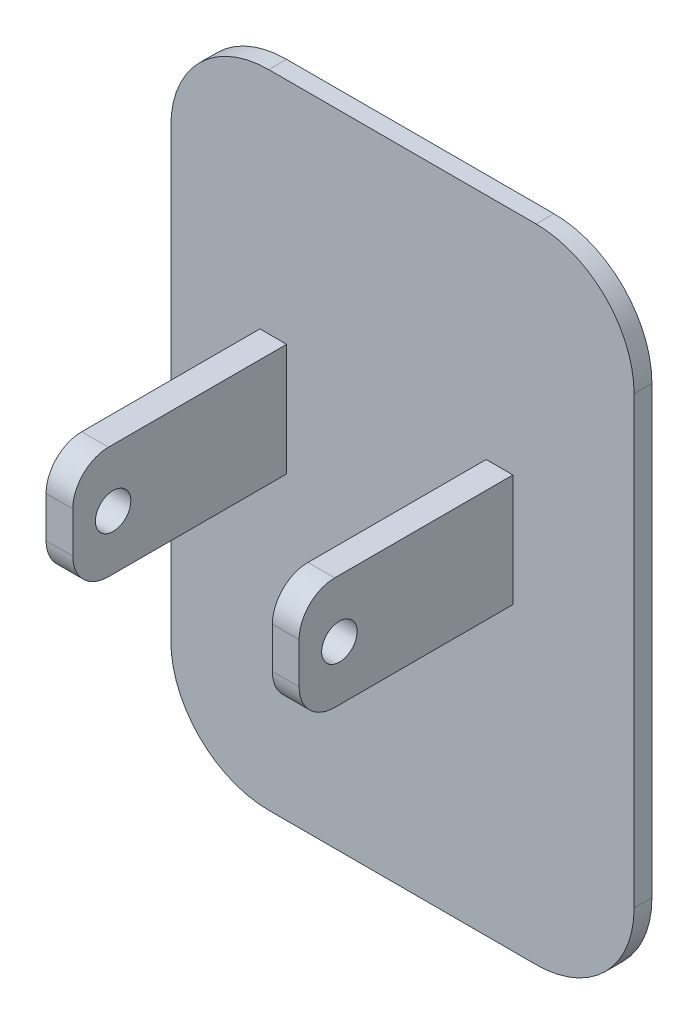
ISO-10303-21;
HEADER;
FILE_DESCRIPTION(('STEP AP214'),'2;1');
FILE_NAME('part.step','',(''),(''),'','','');
FILE_SCHEMA(('AUTOMOTIVE_DESIGN { 1 0 10303 214 1 1 1 1 }'));
ENDSEC;
DATA;
#1=APPLICATION_CONTEXT('core data for automotive mechanical design processes');
#2=APPLICATION_PROTOCOL_DEFINITION('international standard','automotive_design',2000,#1);
#3=PRODUCT_CONTEXT('',#1,'mechanical');
#4=PRODUCT('Part','Part','',(#3));
#5=PRODUCT_RELATED_PRODUCT_CATEGORY('part','',(#4));
#6=PRODUCT_DEFINITION_FORMATION('','',#4);
#7=PRODUCT_DEFINITION_CONTEXT('part definition',#1,'design');
#8=PRODUCT_DEFINITION('design','',#6,#7);
#9=PRODUCT_DEFINITION_SHAPE('','',#8);
#10=(LENGTH_UNIT() NAMED_UNIT(*) SI_UNIT(.MILLI.,.METRE.));
#11=(NAMED_UNIT(*) PLANE_ANGLE_UNIT() SI_UNIT($,.RADIAN.));
#12=(NAMED_UNIT(*) SI_UNIT($,.STERADIAN.) SOLID_ANGLE_UNIT());
#13=UNCERTAINTY_MEASURE_WITH_UNIT(LENGTH_MEASURE(1.E-05),#10,'distance_accuracy_value','');
#14=(GEOMETRIC_REPRESENTATION_CONTEXT(3) GLOBAL_UNCERTAINTY_ASSIGNED_CONTEXT((#13)) GLOBAL_UNIT_ASSIGNED_CONTEXT((#10,
#11,#12)) REPRESENTATION_CONTEXT('',''));
#15=CARTESIAN_POINT('',(0.,0.,0.));
#16=DIRECTION('',(0.,0.,1.));
#17=DIRECTION('',(1.,0.,0.));
#18=AXIS2_PLACEMENT_3D('',#15,#16,#17);
#19=CARTESIAN_POINT('',(5.6,0.713496203822698,13.));
#20=DIRECTION('',(1.,0.,0.));
#21=DIRECTION('',(0.,0.,-1.));
#22=AXIS2_PLACEMENT_3D('',#19,#20,#21);
#23=PLANE('',#22);
#24=CARTESIAN_POINT('',(5.6,3.78102445689793,10.7396030722265));
#25=DIRECTION('',(1.,0.,0.));
#26=DIRECTION('',(0.,0.,-1.));
#27=AXIS2_PLACEMENT_3D('',#24,#25,#26);
#28=CIRCLE('',#27,0.994767201304551);
#29=CARTESIAN_POINT('',(5.6,3.78102445689793,9.74483587092197));
#30=VERTEX_POINT('',#29);
#31=EDGE_CURVE('E248',#30,#30,#28,.T.);
#32=ORIENTED_EDGE('',*,*,#31,.T.);
#33=EDGE_LOOP('',(#32));
#34=FACE_BOUND('',#33,.T.);
#35=DIRECTION('',(0.,-1.,0.));
#36=VECTOR('',#35,1.);
#37=CARTESIAN_POINT('',(5.6,0.713496203822698,13.));
#38=LINE('',#37,#36);
#39=CARTESIAN_POINT('',(5.6,5.0134962038227,13.));
#40=VERTEX_POINT('',#39);
#41=CARTESIAN_POINT('',(5.6,2.7134962038227,13.));
#42=VERTEX_POINT('',#41);
#43=EDGE_CURVE('E117',#40,#42,#38,.T.);
#44=ORIENTED_EDGE('',*,*,#43,.F.);
#45=CARTESIAN_POINT('',(5.6,5.0134962038227,11.));
#46=DIRECTION('',(1.,0.,0.));
#47=DIRECTION('',(0.,0.,-1.));
#48=AXIS2_PLACEMENT_3D('',#45,#46,#47);
#49=CIRCLE('',#48,2.);
#50=CARTESIAN_POINT('',(5.6,7.0134962038227,11.));
#51=VERTEX_POINT('',#50);
#52=EDGE_CURVE('E106',#40,#51,#49,.F.);
#53=ORIENTED_EDGE('',*,*,#52,.T.);
#54=DIRECTION('',(0.,0.,-1.));
#55=VECTOR('',#54,1.);
#56=CARTESIAN_POINT('',(5.6,7.0134962038227,13.));
#57=LINE('',#56,#55);
#58=CARTESIAN_POINT('',(5.6,7.0134962038227,1.));
#59=VERTEX_POINT('',#58);
#60=EDGE_CURVE('E100',#51,#59,#57,.T.);
#61=ORIENTED_EDGE('',*,*,#60,.T.);
#62=DIRECTION('',(0.,-1.,0.));
#63=VECTOR('',#62,1.);
#64=CARTESIAN_POINT('',(5.6,0.713496203822698,1.));
#65=LINE('',#64,#63);
#66=CARTESIAN_POINT('',(5.6,0.713496203822698,1.));
#67=VERTEX_POINT('',#66);
#68=EDGE_CURVE('E105',#59,#67,#65,.T.);
#69=ORIENTED_EDGE('',*,*,#68,.T.);
#70=DIRECTION('',(0.,0.,-1.));
#71=VECTOR('',#70,1.);
#72=CARTESIAN_POINT('',(5.6,0.713496203822698,13.));
#73=LINE('',#72,#71);
#74=CARTESIAN_POINT('',(5.6,0.713496203822698,11.));
#75=VERTEX_POINT('',#74);
#76=EDGE_CURVE('E250',#75,#67,#73,.T.);
#77=ORIENTED_EDGE('',*,*,#76,.F.);
#78=CARTESIAN_POINT('',(5.6,2.7134962038227,11.));
#79=DIRECTION('',(1.,0.,0.));
#80=DIRECTION('',(0.,0.,-1.));
#81=AXIS2_PLACEMENT_3D('',#78,#79,#80);
#82=CIRCLE('',#81,2.);
#83=EDGE_CURVE('E137',#75,#42,#82,.F.);
#84=ORIENTED_EDGE('',*,*,#83,.T.);
#85=EDGE_LOOP('',(#44,#53,#61,#69,#77,#84));
#86=FACE_BOUND('',#85,.T.);
#87=ADVANCED_FACE('F48',(#34,#86),#23,.F.);
#88=CARTESIAN_POINT('',(5.6,0.713496203822698,13.));
#89=DIRECTION('',(0.,1.,0.));
#90=DIRECTION('',(0.,0.,1.));
#91=AXIS2_PLACEMENT_3D('',#88,#89,#90);
#92=PLANE('',#91);
#93=DIRECTION('',(0.,0.,-1.));
#94=VECTOR('',#93,1.);
#95=CARTESIAN_POINT('',(7.1,0.713496203822698,13.));
#96=LINE('',#95,#94);
#97=CARTESIAN_POINT('',(7.1,0.713496203822698,11.));
#98=VERTEX_POINT('',#97);
#99=CARTESIAN_POINT('',(7.1,0.713496203822698,1.));
#100=VERTEX_POINT('',#99);
#101=EDGE_CURVE('E254',#98,#100,#96,.T.);
#102=ORIENTED_EDGE('',*,*,#101,.F.);
#103=DIRECTION('',(1.,0.,0.));
#104=VECTOR('',#103,1.);
#105=CARTESIAN_POINT('',(5.6,0.713496203822698,11.));
#106=LINE('',#105,#104);
#107=EDGE_CURVE('E12',#98,#75,#106,.F.);
#108=ORIENTED_EDGE('',*,*,#107,.T.);
#109=ORIENTED_EDGE('',*,*,#76,.T.);
#110=DIRECTION('',(1.,0.,0.));
#111=VECTOR('',#110,1.);
#112=CARTESIAN_POINT('',(5.6,0.713496203822698,1.));
#113=LINE('',#112,#111);
#114=EDGE_CURVE('E122',#67,#100,#113,.T.);
#115=ORIENTED_EDGE('',*,*,#114,.T.);
#116=EDGE_LOOP('',(#102,#108,#109,#115));
#117=FACE_BOUND('',#116,.T.);
#118=ADVANCED_FACE('F160',(#117),#92,.F.);
#119=CARTESIAN_POINT('',(7.1,0.713496203822698,13.));
#120=DIRECTION('',(-1.,0.,0.));
#121=DIRECTION('',(0.,0.,1.));
#122=AXIS2_PLACEMENT_3D('',#119,#120,#121);
#123=PLANE('',#122);
#124=CARTESIAN_POINT('',(7.1,3.78102445689793,10.7396030722265));
#125=DIRECTION('',(1.,0.,0.));
#126=DIRECTION('',(0.,0.,-1.));
#127=AXIS2_PLACEMENT_3D('',#124,#125,#126);
#128=CIRCLE('',#127,0.994767201304551);
#129=CARTESIAN_POINT('',(7.1,3.78102445689793,9.74483587092197));
#130=VERTEX_POINT('',#129);
#131=EDGE_CURVE('E247',#130,#130,#128,.T.);
#132=ORIENTED_EDGE('',*,*,#131,.F.);
#133=EDGE_LOOP('',(#132));
#134=FACE_BOUND('',#133,.T.);
#135=DIRECTION('',(0.,0.,-1.));
#136=VECTOR('',#135,1.);
#137=CARTESIAN_POINT('',(7.1,7.0134962038227,13.));
#138=LINE('',#137,#136);
#139=CARTESIAN_POINT('',(7.1,7.0134962038227,11.));
#140=VERTEX_POINT('',#139);
#141=CARTESIAN_POINT('',(7.1,7.0134962038227,1.));
#142=VERTEX_POINT('',#141);
#143=EDGE_CURVE('E108',#140,#142,#138,.T.);
#144=ORIENTED_EDGE('',*,*,#143,.F.);
#145=CARTESIAN_POINT('',(7.1,5.0134962038227,11.));
#146=DIRECTION('',(-1.,0.,0.));
#147=DIRECTION('',(0.,0.,1.));
#148=AXIS2_PLACEMENT_3D('',#145,#146,#147);
#149=CIRCLE('',#148,2.);
#150=CARTESIAN_POINT('',(7.1,5.0134962038227,13.));
#151=VERTEX_POINT('',#150);
#152=EDGE_CURVE('E56',#140,#151,#149,.F.);
#153=ORIENTED_EDGE('',*,*,#152,.T.);
#154=DIRECTION('',(0.,1.,0.));
#155=VECTOR('',#154,1.);
#156=CARTESIAN_POINT('',(7.1,0.713496203822698,13.));
#157=LINE('',#156,#155);
#158=CARTESIAN_POINT('',(7.1,2.7134962038227,13.));
#159=VERTEX_POINT('',#158);
#160=EDGE_CURVE('E107',#159,#151,#157,.T.);
#161=ORIENTED_EDGE('',*,*,#160,.F.);
#162=CARTESIAN_POINT('',(7.1,2.7134962038227,11.));
#163=DIRECTION('',(-1.,0.,0.));
#164=DIRECTION('',(0.,0.,1.));
#165=AXIS2_PLACEMENT_3D('',#162,#163,#164);
#166=CIRCLE('',#165,2.);
#167=EDGE_CURVE('E63',#159,#98,#166,.F.);
#168=ORIENTED_EDGE('',*,*,#167,.T.);
#169=ORIENTED_EDGE('',*,*,#101,.T.);
#170=DIRECTION('',(0.,1.,0.));
#171=VECTOR('',#170,1.);
#172=CARTESIAN_POINT('',(7.1,0.713496203822698,1.));
#173=LINE('',#172,#171);
#174=EDGE_CURVE('E116',#100,#142,#173,.T.);
#175=ORIENTED_EDGE('',*,*,#174,.T.);
#176=EDGE_LOOP('',(#144,#153,#161,#168,#169,#175));
#177=FACE_BOUND('',#176,.T.);
#178=ADVANCED_FACE('F142',(#134,#177),#123,.F.);
#179=CARTESIAN_POINT('',(5.6,7.0134962038227,13.));
#180=DIRECTION('',(0.,-1.,0.));
#181=DIRECTION('',(0.,0.,-1.));
#182=AXIS2_PLACEMENT_3D('',#179,#180,#181);
#183=PLANE('',#182);
#184=ORIENTED_EDGE('',*,*,#60,.F.);
#185=DIRECTION('',(-1.,0.,0.));
#186=VECTOR('',#185,1.);
#187=CARTESIAN_POINT('',(5.6,7.0134962038227,11.));
#188=LINE('',#187,#186);
#189=EDGE_CURVE('E71',#51,#140,#188,.F.);
#190=ORIENTED_EDGE('',*,*,#189,.T.);
#191=ORIENTED_EDGE('',*,*,#143,.T.);
#192=DIRECTION('',(-1.,0.,0.));
#193=VECTOR('',#192,1.);
#194=CARTESIAN_POINT('',(5.6,7.0134962038227,1.));
#195=LINE('',#194,#193);
#196=EDGE_CURVE('E111',#142,#59,#195,.T.);
#197=ORIENTED_EDGE('',*,*,#196,.T.);
#198=EDGE_LOOP('',(#184,#190,#191,#197));
#199=FACE_BOUND('',#198,.T.);
#200=ADVANCED_FACE('F112',(#199),#183,.F.);
#201=CARTESIAN_POINT('',(0.,0.,13.));
#202=DIRECTION('',(0.,0.,-1.));
#203=DIRECTION('',(-1.,0.,0.));
#204=AXIS2_PLACEMENT_3D('',#201,#202,#203);
#205=PLANE('',#204);
#206=ORIENTED_EDGE('',*,*,#160,.T.);
#207=DIRECTION('',(-1.,0.,0.));
#208=VECTOR('',#207,1.);
#209=CARTESIAN_POINT('',(0.,5.0134962038227,13.));
#210=LINE('',#209,#208);
#211=EDGE_CURVE('E126',#151,#40,#210,.T.);
#212=ORIENTED_EDGE('',*,*,#211,.T.);
#213=ORIENTED_EDGE('',*,*,#43,.T.);
#214=DIRECTION('',(1.,0.,0.));
#215=VECTOR('',#214,1.);
#216=CARTESIAN_POINT('',(0.,2.7134962038227,13.));
#217=LINE('',#216,#215);
#218=EDGE_CURVE('E123',#42,#159,#217,.T.);
#219=ORIENTED_EDGE('',*,*,#218,.T.);
#220=EDGE_LOOP('',(#206,#212,#213,#219));
#221=FACE_BOUND('',#220,.T.);
#222=ADVANCED_FACE('F146',(#221),#205,.F.);
#223=CARTESIAN_POINT('',(0.,0.,1.));
#224=DIRECTION('',(0.,0.,-1.));
#225=DIRECTION('',(-1.,0.,0.));
#226=AXIS2_PLACEMENT_3D('',#223,#224,#225);
#227=PLANE('',#226);
#228=ORIENTED_EDGE('',*,*,#68,.F.);
#229=ORIENTED_EDGE('',*,*,#196,.F.);
#230=ORIENTED_EDGE('',*,*,#174,.F.);
#231=ORIENTED_EDGE('',*,*,#114,.F.);
#232=EDGE_LOOP('',(#228,#229,#230,#231));
#233=FACE_BOUND('',#232,.T.);
#234=ADVANCED_FACE('F120',(#233),#227,.T.);
#235=CARTESIAN_POINT('',(-12.1,3.78102445689793,10.7396030722265));
#236=DIRECTION('',(1.,0.,0.));
#237=DIRECTION('',(0.,0.,-1.));
#238=AXIS2_PLACEMENT_3D('',#235,#236,#237);
#239=CYLINDRICAL_SURFACE('',#238,0.994767201304551);
#240=ORIENTED_EDGE('',*,*,#131,.T.);
#241=EDGE_LOOP('',(#240));
#242=FACE_BOUND('',#241,.T.);
#243=ORIENTED_EDGE('',*,*,#31,.F.);
#244=EDGE_LOOP('',(#243));
#245=FACE_BOUND('',#244,.T.);
#246=ADVANCED_FACE('F150',(#242,#245),#239,.F.);
#247=CARTESIAN_POINT('',(0.,5.0134962038227,11.));
#248=DIRECTION('',(-1.,0.,0.));
#249=DIRECTION('',(0.,0.,1.));
#250=AXIS2_PLACEMENT_3D('',#247,#248,#249);
#251=CYLINDRICAL_SURFACE('',#250,2.);
#252=ORIENTED_EDGE('',*,*,#152,.F.);
#253=ORIENTED_EDGE('',*,*,#189,.F.);
#254=ORIENTED_EDGE('',*,*,#52,.F.);
#255=ORIENTED_EDGE('',*,*,#211,.F.);
#256=EDGE_LOOP('',(#252,#253,#254,#255));
#257=FACE_BOUND('',#256,.T.);
#258=ADVANCED_FACE('F148',(#257),#251,.T.);
#259=CARTESIAN_POINT('',(0.,2.7134962038227,11.));
#260=DIRECTION('',(1.,0.,0.));
#261=DIRECTION('',(0.,0.,-1.));
#262=AXIS2_PLACEMENT_3D('',#259,#260,#261);
#263=CYLINDRICAL_SURFACE('',#262,2.);
#264=ORIENTED_EDGE('',*,*,#83,.F.);
#265=ORIENTED_EDGE('',*,*,#107,.F.);
#266=ORIENTED_EDGE('',*,*,#167,.F.);
#267=ORIENTED_EDGE('',*,*,#218,.F.);
#268=EDGE_LOOP('',(#264,#265,#266,#267));
#269=FACE_BOUND('',#268,.T.);
#270=ADVANCED_FACE('F50',(#269),#263,.T.);
#271=CLOSED_SHELL('',(#87,#118,#178,#200,#222,#234,#246,#258,#270));
#272=MANIFOLD_SOLID_BREP('B2',#271);
#273=CARTESIAN_POINT('',(-7.1,0.713496203822699,13.));
#274=DIRECTION('',(1.,0.,0.));
#275=DIRECTION('',(0.,0.,-1.));
#276=AXIS2_PLACEMENT_3D('',#273,#274,#275);
#277=PLANE('',#276);
#278=CARTESIAN_POINT('',(-7.1,3.78102445689793,10.7396030722265));
#279=DIRECTION('',(1.,0.,0.));
#280=DIRECTION('',(0.,0.,-1.));
#281=AXIS2_PLACEMENT_3D('',#278,#279,#280);
#282=CIRCLE('',#281,0.994767201304551);
#283=CARTESIAN_POINT('',(-7.1,3.78102445689793,9.74483587092197));
#284=VERTEX_POINT('',#283);
#285=EDGE_CURVE('E348',#284,#284,#282,.T.);
#286=ORIENTED_EDGE('',*,*,#285,.T.);
#287=EDGE_LOOP('',(#286));
#288=FACE_BOUND('',#287,.T.);
#289=DIRECTION('',(0.,-1.,0.));
#290=VECTOR('',#289,1.);
#291=CARTESIAN_POINT('',(-7.1,0.713496203822699,13.));
#292=LINE('',#291,#290);
#293=CARTESIAN_POINT('',(-7.1,5.0134962038227,13.));
#294=VERTEX_POINT('',#293);
#295=CARTESIAN_POINT('',(-7.1,2.7134962038227,13.));
#296=VERTEX_POINT('',#295);
#297=EDGE_CURVE('E360',#294,#296,#292,.T.);
#298=ORIENTED_EDGE('',*,*,#297,.F.);
#299=CARTESIAN_POINT('',(-7.1,5.0134962038227,11.));
#300=DIRECTION('',(1.,0.,0.));
#301=DIRECTION('',(0.,0.,-1.));
#302=AXIS2_PLACEMENT_3D('',#299,#300,#301);
#303=CIRCLE('',#302,2.);
#304=CARTESIAN_POINT('',(-7.1,7.0134962038227,11.));
#305=VERTEX_POINT('',#304);
#306=EDGE_CURVE('E374',#294,#305,#303,.F.);
#307=ORIENTED_EDGE('',*,*,#306,.T.);
#308=DIRECTION('',(0.,0.,-1.));
#309=VECTOR('',#308,1.);
#310=CARTESIAN_POINT('',(-7.1,7.0134962038227,13.));
#311=LINE('',#310,#309);
#312=CARTESIAN_POINT('',(-7.1,7.0134962038227,1.));
#313=VERTEX_POINT('',#312);
#314=EDGE_CURVE('E346',#305,#313,#311,.T.);
#315=ORIENTED_EDGE('',*,*,#314,.T.);
#316=DIRECTION('',(0.,-1.,0.));
#317=VECTOR('',#316,1.);
#318=CARTESIAN_POINT('',(-7.1,0.713496203822699,1.));
#319=LINE('',#318,#317);
#320=CARTESIAN_POINT('',(-7.1,0.713496203822699,1.));
#321=VERTEX_POINT('',#320);
#322=EDGE_CURVE('E341',#313,#321,#319,.T.);
#323=ORIENTED_EDGE('',*,*,#322,.T.);
#324=DIRECTION('',(0.,0.,-1.));
#325=VECTOR('',#324,1.);
#326=CARTESIAN_POINT('',(-7.1,0.713496203822699,13.));
#327=LINE('',#326,#325);
#328=CARTESIAN_POINT('',(-7.1,0.713496203822699,11.));
#329=VERTEX_POINT('',#328);
#330=EDGE_CURVE('E325',#329,#321,#327,.T.);
#331=ORIENTED_EDGE('',*,*,#330,.F.);
#332=CARTESIAN_POINT('',(-7.1,2.7134962038227,11.));
#333=DIRECTION('',(1.,0.,0.));
#334=DIRECTION('',(0.,0.,-1.));
#335=AXIS2_PLACEMENT_3D('',#332,#333,#334);
#336=CIRCLE('',#335,2.);
#337=EDGE_CURVE('E372',#329,#296,#336,.F.);
#338=ORIENTED_EDGE('',*,*,#337,.T.);
#339=EDGE_LOOP('',(#298,#307,#315,#323,#331,#338));
#340=FACE_BOUND('',#339,.T.);
#341=ADVANCED_FACE('F272',(#288,#340),#277,.F.);
#342=CARTESIAN_POINT('',(-7.1,0.713496203822699,13.));
#343=DIRECTION('',(0.,1.,0.));
#344=DIRECTION('',(0.,0.,1.));
#345=AXIS2_PLACEMENT_3D('',#342,#343,#344);
#346=PLANE('',#345);
#347=DIRECTION('',(0.,0.,-1.));
#348=VECTOR('',#347,1.);
#349=CARTESIAN_POINT('',(-5.6,0.713496203822699,13.));
#350=LINE('',#349,#348);
#351=CARTESIAN_POINT('',(-5.6,0.713496203822699,11.));
#352=VERTEX_POINT('',#351);
#353=CARTESIAN_POINT('',(-5.6,0.713496203822699,1.));
#354=VERTEX_POINT('',#353);
#355=EDGE_CURVE('E335',#352,#354,#350,.T.);
#356=ORIENTED_EDGE('',*,*,#355,.F.);
#357=DIRECTION('',(1.,0.,0.));
#358=VECTOR('',#357,1.);
#359=CARTESIAN_POINT('',(-7.1,0.713496203822699,11.));
#360=LINE('',#359,#358);
#361=EDGE_CURVE('E46',#352,#329,#360,.F.);
#362=ORIENTED_EDGE('',*,*,#361,.T.);
#363=ORIENTED_EDGE('',*,*,#330,.T.);
#364=DIRECTION('',(1.,0.,0.));
#365=VECTOR('',#364,1.);
#366=CARTESIAN_POINT('',(-7.1,0.713496203822699,1.));
#367=LINE('',#366,#365);
#368=EDGE_CURVE('E328',#321,#354,#367,.T.);
#369=ORIENTED_EDGE('',*,*,#368,.T.);
#370=EDGE_LOOP('',(#356,#362,#363,#369));
#371=FACE_BOUND('',#370,.T.);
#372=ADVANCED_FACE('F327',(#371),#346,.F.);
#373=CARTESIAN_POINT('',(-5.6,0.713496203822699,13.));
#374=DIRECTION('',(-1.,0.,0.));
#375=DIRECTION('',(0.,0.,1.));
#376=AXIS2_PLACEMENT_3D('',#373,#374,#375);
#377=PLANE('',#376);
#378=CARTESIAN_POINT('',(-5.6,3.78102445689793,10.7396030722265));
#379=DIRECTION('',(-1.,0.,0.));
#380=DIRECTION('',(0.,0.,1.));
#381=AXIS2_PLACEMENT_3D('',#378,#379,#380);
#382=CIRCLE('',#381,0.994767201304551);
#383=CARTESIAN_POINT('',(-5.6,3.78102445689793,11.7343702735311));
#384=VERTEX_POINT('',#383);
#385=EDGE_CURVE('E351',#384,#384,#382,.T.);
#386=ORIENTED_EDGE('',*,*,#385,.T.);
#387=EDGE_LOOP('',(#386));
#388=FACE_BOUND('',#387,.T.);
#389=DIRECTION('',(0.,0.,-1.));
#390=VECTOR('',#389,1.);
#391=CARTESIAN_POINT('',(-5.6,7.0134962038227,13.));
#392=LINE('',#391,#390);
#393=CARTESIAN_POINT('',(-5.6,7.0134962038227,11.));
#394=VERTEX_POINT('',#393);
#395=CARTESIAN_POINT('',(-5.6,7.0134962038227,1.));
#396=VERTEX_POINT('',#395);
#397=EDGE_CURVE('E362',#394,#396,#392,.T.);
#398=ORIENTED_EDGE('',*,*,#397,.F.);
#399=CARTESIAN_POINT('',(-5.6,5.0134962038227,11.));
#400=DIRECTION('',(-1.,0.,0.));
#401=DIRECTION('',(0.,0.,1.));
#402=AXIS2_PLACEMENT_3D('',#399,#400,#401);
#403=CIRCLE('',#402,2.);
#404=CARTESIAN_POINT('',(-5.6,5.0134962038227,13.));
#405=VERTEX_POINT('',#404);
#406=EDGE_CURVE('E280',#394,#405,#403,.F.);
#407=ORIENTED_EDGE('',*,*,#406,.T.);
#408=DIRECTION('',(0.,1.,0.));
#409=VECTOR('',#408,1.);
#410=CARTESIAN_POINT('',(-5.6,0.713496203822699,13.));
#411=LINE('',#410,#409);
#412=CARTESIAN_POINT('',(-5.6,2.7134962038227,13.));
#413=VERTEX_POINT('',#412);
#414=EDGE_CURVE('E354',#413,#405,#411,.T.);
#415=ORIENTED_EDGE('',*,*,#414,.F.);
#416=CARTESIAN_POINT('',(-5.6,2.7134962038227,11.));
#417=DIRECTION('',(-1.,0.,0.));
#418=DIRECTION('',(0.,0.,1.));
#419=AXIS2_PLACEMENT_3D('',#416,#417,#418);
#420=CIRCLE('',#419,2.);
#421=EDGE_CURVE('E287',#413,#352,#420,.F.);
#422=ORIENTED_EDGE('',*,*,#421,.T.);
#423=ORIENTED_EDGE('',*,*,#355,.T.);
#424=DIRECTION('',(0.,1.,0.));
#425=VECTOR('',#424,1.);
#426=CARTESIAN_POINT('',(-5.6,0.713496203822699,1.));
#427=LINE('',#426,#425);
#428=EDGE_CURVE('E343',#354,#396,#427,.T.);
#429=ORIENTED_EDGE('',*,*,#428,.T.);
#430=EDGE_LOOP('',(#398,#407,#415,#422,#423,#429));
#431=FACE_BOUND('',#430,.T.);
#432=ADVANCED_FACE('F379',(#388,#431),#377,.F.);
#433=CARTESIAN_POINT('',(-7.1,7.0134962038227,13.));
#434=DIRECTION('',(0.,-1.,0.));
#435=DIRECTION('',(0.,0.,-1.));
#436=AXIS2_PLACEMENT_3D('',#433,#434,#435);
#437=PLANE('',#436);
#438=ORIENTED_EDGE('',*,*,#314,.F.);
#439=DIRECTION('',(-1.,0.,0.));
#440=VECTOR('',#439,1.);
#441=CARTESIAN_POINT('',(-7.1,7.0134962038227,11.));
#442=LINE('',#441,#440);
#443=EDGE_CURVE('E295',#305,#394,#442,.F.);
#444=ORIENTED_EDGE('',*,*,#443,.T.);
#445=ORIENTED_EDGE('',*,*,#397,.T.);
#446=DIRECTION('',(-1.,0.,0.));
#447=VECTOR('',#446,1.);
#448=CARTESIAN_POINT('',(-7.1,7.0134962038227,1.));
#449=LINE('',#448,#447);
#450=EDGE_CURVE('E358',#396,#313,#449,.T.);
#451=ORIENTED_EDGE('',*,*,#450,.T.);
#452=EDGE_LOOP('',(#438,#444,#445,#451));
#453=FACE_BOUND('',#452,.T.);
#454=ADVANCED_FACE('F387',(#453),#437,.F.);
#455=CARTESIAN_POINT('',(0.,0.,13.));
#456=DIRECTION('',(0.,0.,-1.));
#457=DIRECTION('',(-1.,0.,0.));
#458=AXIS2_PLACEMENT_3D('',#455,#456,#457);
#459=PLANE('',#458);
#460=ORIENTED_EDGE('',*,*,#414,.T.);
#461=DIRECTION('',(-1.,0.,0.));
#462=VECTOR('',#461,1.);
#463=CARTESIAN_POINT('',(0.,5.0134962038227,13.));
#464=LINE('',#463,#462);
#465=EDGE_CURVE('E369',#405,#294,#464,.T.);
#466=ORIENTED_EDGE('',*,*,#465,.T.);
#467=ORIENTED_EDGE('',*,*,#297,.T.);
#468=DIRECTION('',(1.,0.,0.));
#469=VECTOR('',#468,1.);
#470=CARTESIAN_POINT('',(0.,2.7134962038227,13.));
#471=LINE('',#470,#469);
#472=EDGE_CURVE('E334',#296,#413,#471,.T.);
#473=ORIENTED_EDGE('',*,*,#472,.T.);
#474=EDGE_LOOP('',(#460,#466,#467,#473));
#475=FACE_BOUND('',#474,.T.);
#476=ADVANCED_FACE('F383',(#475),#459,.F.);
#477=CARTESIAN_POINT('',(0.,0.,1.));
#478=DIRECTION('',(0.,0.,-1.));
#479=DIRECTION('',(-1.,0.,0.));
#480=AXIS2_PLACEMENT_3D('',#477,#478,#479);
#481=PLANE('',#480);
#482=ORIENTED_EDGE('',*,*,#322,.F.);
#483=ORIENTED_EDGE('',*,*,#450,.F.);
#484=ORIENTED_EDGE('',*,*,#428,.F.);
#485=ORIENTED_EDGE('',*,*,#368,.F.);
#486=EDGE_LOOP('',(#482,#483,#484,#485));
#487=FACE_BOUND('',#486,.T.);
#488=ADVANCED_FACE('F339',(#487),#481,.T.);
#489=CARTESIAN_POINT('',(-12.1,3.78102445689793,10.7396030722265));
#490=DIRECTION('',(1.,0.,0.));
#491=DIRECTION('',(0.,0.,-1.));
#492=AXIS2_PLACEMENT_3D('',#489,#490,#491);
#493=CYLINDRICAL_SURFACE('',#492,0.994767201304551);
#494=ORIENTED_EDGE('',*,*,#385,.F.);
#495=EDGE_LOOP('',(#494));
#496=FACE_BOUND('',#495,.T.);
#497=ORIENTED_EDGE('',*,*,#285,.F.);
#498=EDGE_LOOP('',(#497));
#499=FACE_BOUND('',#498,.T.);
#500=ADVANCED_FACE('F393',(#496,#499),#493,.F.);
#501=CARTESIAN_POINT('',(0.,5.0134962038227,11.));
#502=DIRECTION('',(-1.,0.,0.));
#503=DIRECTION('',(0.,0.,1.));
#504=AXIS2_PLACEMENT_3D('',#501,#502,#503);
#505=CYLINDRICAL_SURFACE('',#504,2.);
#506=ORIENTED_EDGE('',*,*,#406,.F.);
#507=ORIENTED_EDGE('',*,*,#443,.F.);
#508=ORIENTED_EDGE('',*,*,#306,.F.);
#509=ORIENTED_EDGE('',*,*,#465,.F.);
#510=EDGE_LOOP('',(#506,#507,#508,#509));
#511=FACE_BOUND('',#510,.T.);
#512=ADVANCED_FACE('F386',(#511),#505,.T.);
#513=CARTESIAN_POINT('',(0.,2.7134962038227,11.));
#514=DIRECTION('',(1.,0.,0.));
#515=DIRECTION('',(0.,0.,-1.));
#516=AXIS2_PLACEMENT_3D('',#513,#514,#515);
#517=CYLINDRICAL_SURFACE('',#516,2.);
#518=ORIENTED_EDGE('',*,*,#337,.F.);
#519=ORIENTED_EDGE('',*,*,#361,.F.);
#520=ORIENTED_EDGE('',*,*,#421,.F.);
#521=ORIENTED_EDGE('',*,*,#472,.F.);
#522=EDGE_LOOP('',(#518,#519,#520,#521));
#523=FACE_BOUND('',#522,.T.);
#524=ADVANCED_FACE('F274',(#523),#517,.T.);
#525=CLOSED_SHELL('',(#341,#372,#432,#454,#476,#488,#500,#512,#524));
#526=MANIFOLD_SOLID_BREP('B6',#525);
#527=CARTESIAN_POINT('',(8.4,-10.637455145618,1.));
#528=DIRECTION('',(0.,0.,1.));
#529=DIRECTION('',(1.,0.,0.));
#530=AXIS2_PLACEMENT_3D('',#527,#528,#529);
#531=PLANE('',#530);
#532=CARTESIAN_POINT('',(8.4,-10.637455145618,1.));
#533=DIRECTION('',(0.,0.,1.));
#534=DIRECTION('',(1.,0.,0.));
#535=AXIS2_PLACEMENT_3D('',#532,#533,#534);
#536=CIRCLE('',#535,5.5);
#537=CARTESIAN_POINT('',(8.4,-16.137455145618,1.));
#538=VERTEX_POINT('',#537);
#539=CARTESIAN_POINT('',(13.9,-10.637455145618,1.));
#540=VERTEX_POINT('',#539);
#541=EDGE_CURVE('E667',#538,#540,#536,.T.);
#542=ORIENTED_EDGE('',*,*,#541,.T.);
#543=DIRECTION('',(0.,1.,0.));
#544=VECTOR('',#543,1.);
#545=CARTESIAN_POINT('',(13.9,-10.637455145618,1.));
#546=LINE('',#545,#544);
#547=CARTESIAN_POINT('',(13.9,14.362544854382,1.));
#548=VERTEX_POINT('',#547);
#549=EDGE_CURVE('E670',#540,#548,#546,.T.);
#550=ORIENTED_EDGE('',*,*,#549,.T.);
#551=CARTESIAN_POINT('',(8.4,14.362544854382,1.));
#552=DIRECTION('',(0.,0.,1.));
#553=DIRECTION('',(1.,0.,0.));
#554=AXIS2_PLACEMENT_3D('',#551,#552,#553);
#555=CIRCLE('',#554,5.5);
#556=CARTESIAN_POINT('',(8.4,19.862544854382,1.));
#557=VERTEX_POINT('',#556);
#558=EDGE_CURVE('E673',#548,#557,#555,.T.);
#559=ORIENTED_EDGE('',*,*,#558,.T.);
#560=DIRECTION('',(-1.,0.,0.));
#561=VECTOR('',#560,1.);
#562=CARTESIAN_POINT('',(8.4,19.862544854382,1.));
#563=LINE('',#562,#561);
#564=CARTESIAN_POINT('',(-6.6,19.862544854382,1.));
#565=VERTEX_POINT('',#564);
#566=EDGE_CURVE('E675',#557,#565,#563,.T.);
#567=ORIENTED_EDGE('',*,*,#566,.T.);
#568=CARTESIAN_POINT('',(-6.6,14.362544854382,1.));
#569=DIRECTION('',(0.,0.,1.));
#570=DIRECTION('',(1.,0.,0.));
#571=AXIS2_PLACEMENT_3D('',#568,#569,#570);
#572=CIRCLE('',#571,5.5);
#573=CARTESIAN_POINT('',(-12.1,14.362544854382,1.));
#574=VERTEX_POINT('',#573);
#575=EDGE_CURVE('E677',#565,#574,#572,.T.);
#576=ORIENTED_EDGE('',*,*,#575,.T.);
#577=DIRECTION('',(0.,-1.,0.));
#578=VECTOR('',#577,1.);
#579=CARTESIAN_POINT('',(-12.1,14.362544854382,1.));
#580=LINE('',#579,#578);
#581=CARTESIAN_POINT('',(-12.1,-10.637455145618,1.));
#582=VERTEX_POINT('',#581);
#583=EDGE_CURVE('E679',#574,#582,#580,.T.);
#584=ORIENTED_EDGE('',*,*,#583,.T.);
#585=CARTESIAN_POINT('',(-6.6,-10.637455145618,1.));
#586=DIRECTION('',(0.,0.,1.));
#587=DIRECTION('',(1.,0.,0.));
#588=AXIS2_PLACEMENT_3D('',#585,#586,#587);
#589=CIRCLE('',#588,5.5);
#590=CARTESIAN_POINT('',(-6.6,-16.137455145618,1.));
#591=VERTEX_POINT('',#590);
#592=EDGE_CURVE('E681',#582,#591,#589,.T.);
#593=ORIENTED_EDGE('',*,*,#592,.T.);
#594=DIRECTION('',(1.,0.,0.));
#595=VECTOR('',#594,1.);
#596=CARTESIAN_POINT('',(-6.6,-16.137455145618,1.));
#597=LINE('',#596,#595);
#598=EDGE_CURVE('E683',#591,#538,#597,.T.);
#599=ORIENTED_EDGE('',*,*,#598,.T.);
#600=EDGE_LOOP('',(#542,#550,#559,#567,#576,#584,#593,#599));
#601=FACE_BOUND('',#600,.T.);
#602=DIRECTION('',(1.,0.,0.));
#603=VECTOR('',#602,1.);
#604=CARTESIAN_POINT('',(-7.1,0.713496203822699,1.));
#605=LINE('',#604,#603);
#606=CARTESIAN_POINT('',(-7.1,0.713496203822699,1.));
#607=VERTEX_POINT('',#606);
#608=CARTESIAN_POINT('',(-5.6,0.713496203822699,1.));
#609=VERTEX_POINT('',#608);
#610=EDGE_CURVE('E638',#607,#609,#605,.T.);
#611=ORIENTED_EDGE('',*,*,#610,.F.);
#612=DIRECTION('',(0.,-1.,0.));
#613=VECTOR('',#612,1.);
#614=CARTESIAN_POINT('',(-7.1,7.0134962038227,1.));
#615=LINE('',#614,#613);
#616=CARTESIAN_POINT('',(-7.1,7.0134962038227,1.));
#617=VERTEX_POINT('',#616);
#618=EDGE_CURVE('E636',#617,#607,#615,.T.);
#619=ORIENTED_EDGE('',*,*,#618,.F.);
#620=DIRECTION('',(-1.,0.,0.));
#621=VECTOR('',#620,1.);
#622=CARTESIAN_POINT('',(-7.1,7.0134962038227,1.));
#623=LINE('',#622,#621);
#624=CARTESIAN_POINT('',(-5.6,7.0134962038227,1.));
#625=VERTEX_POINT('',#624);
#626=EDGE_CURVE('E644',#625,#617,#623,.T.);
#627=ORIENTED_EDGE('',*,*,#626,.F.);
#628=DIRECTION('',(0.,1.,0.));
#629=VECTOR('',#628,1.);
#630=CARTESIAN_POINT('',(-5.6,7.0134962038227,1.));
#631=LINE('',#630,#629);
#632=EDGE_CURVE('E641',#609,#625,#631,.T.);
#633=ORIENTED_EDGE('',*,*,#632,.F.);
#634=EDGE_LOOP('',(#611,#619,#627,#633));
#635=FACE_BOUND('',#634,.T.);
#636=DIRECTION('',(1.,0.,0.));
#637=VECTOR('',#636,1.);
#638=CARTESIAN_POINT('',(5.6,0.713496203822698,1.));
#639=LINE('',#638,#637);
#640=CARTESIAN_POINT('',(5.6,0.713496203822698,1.));
#641=VERTEX_POINT('',#640);
#642=CARTESIAN_POINT('',(7.1,0.713496203822699,1.));
#643=VERTEX_POINT('',#642);
#644=EDGE_CURVE('E608',#641,#643,#639,.T.);
#645=ORIENTED_EDGE('',*,*,#644,.F.);
#646=DIRECTION('',(0.,-1.,0.));
#647=VECTOR('',#646,1.);
#648=CARTESIAN_POINT('',(5.6,0.713496203822698,1.));
#649=LINE('',#648,#647);
#650=CARTESIAN_POINT('',(5.6,7.0134962038227,1.));
#651=VERTEX_POINT('',#650);
#652=EDGE_CURVE('E600',#651,#641,#649,.T.);
#653=ORIENTED_EDGE('',*,*,#652,.F.);
#654=DIRECTION('',(-1.,0.,0.));
#655=VECTOR('',#654,1.);
#656=CARTESIAN_POINT('',(5.6,7.0134962038227,1.));
#657=LINE('',#656,#655);
#658=CARTESIAN_POINT('',(7.1,7.0134962038227,1.));
#659=VERTEX_POINT('',#658);
#660=EDGE_CURVE('E622',#659,#651,#657,.T.);
#661=ORIENTED_EDGE('',*,*,#660,.F.);
#662=DIRECTION('',(0.,1.,0.));
#663=VECTOR('',#662,1.);
#664=CARTESIAN_POINT('',(7.1,0.713496203822699,1.));
#665=LINE('',#664,#663);
#666=EDGE_CURVE('E620',#643,#659,#665,.T.);
#667=ORIENTED_EDGE('',*,*,#666,.F.);
#668=EDGE_LOOP('',(#645,#653,#661,#667));
#669=FACE_BOUND('',#668,.T.);
#670=ADVANCED_FACE('F487',(#601,#635,#669),#531,.T.);
#671=CARTESIAN_POINT('',(8.4,-10.637455145618,0.));
#672=DIRECTION('',(0.,0.,1.));
#673=DIRECTION('',(1.,0.,0.));
#674=AXIS2_PLACEMENT_3D('',#671,#672,#673);
#675=PLANE('',#674);
#676=DIRECTION('',(0.,-1.,0.));
#677=VECTOR('',#676,1.);
#678=CARTESIAN_POINT('',(-7.1,7.0134962038227,0.));
#679=LINE('',#678,#677);
#680=CARTESIAN_POINT('',(-7.1,7.0134962038227,0.));
#681=VERTEX_POINT('',#680);
#682=CARTESIAN_POINT('',(-7.1,0.713496203822699,0.));
#683=VERTEX_POINT('',#682);
#684=EDGE_CURVE('E616',#681,#683,#679,.T.);
#685=ORIENTED_EDGE('',*,*,#684,.T.);
#686=DIRECTION('',(1.,0.,0.));
#687=VECTOR('',#686,1.);
#688=CARTESIAN_POINT('',(-7.1,0.713496203822699,0.));
#689=LINE('',#688,#687);
#690=CARTESIAN_POINT('',(-5.6,0.713496203822699,0.));
#691=VERTEX_POINT('',#690);
#692=EDGE_CURVE('E649',#683,#691,#689,.T.);
#693=ORIENTED_EDGE('',*,*,#692,.T.);
#694=DIRECTION('',(0.,1.,0.));
#695=VECTOR('',#694,1.);
#696=CARTESIAN_POINT('',(-5.6,7.0134962038227,0.));
#697=LINE('',#696,#695);
#698=CARTESIAN_POINT('',(-5.6,7.0134962038227,0.));
#699=VERTEX_POINT('',#698);
#700=EDGE_CURVE('E652',#691,#699,#697,.T.);
#701=ORIENTED_EDGE('',*,*,#700,.T.);
#702=DIRECTION('',(-1.,0.,0.));
#703=VECTOR('',#702,1.);
#704=CARTESIAN_POINT('',(-7.1,7.0134962038227,0.));
#705=LINE('',#704,#703);
#706=EDGE_CURVE('E639',#699,#681,#705,.T.);
#707=ORIENTED_EDGE('',*,*,#706,.T.);
#708=EDGE_LOOP('',(#685,#693,#701,#707));
#709=FACE_BOUND('',#708,.T.);
#710=CARTESIAN_POINT('',(8.4,-10.637455145618,0.));
#711=DIRECTION('',(0.,0.,1.));
#712=DIRECTION('',(1.,0.,0.));
#713=AXIS2_PLACEMENT_3D('',#710,#711,#712);
#714=CIRCLE('',#713,5.5);
#715=CARTESIAN_POINT('',(8.4,-16.137455145618,0.));
#716=VERTEX_POINT('',#715);
#717=CARTESIAN_POINT('',(13.9,-10.637455145618,0.));
#718=VERTEX_POINT('',#717);
#719=EDGE_CURVE('E666',#716,#718,#714,.T.);
#720=ORIENTED_EDGE('',*,*,#719,.F.);
#721=DIRECTION('',(1.,0.,0.));
#722=VECTOR('',#721,1.);
#723=CARTESIAN_POINT('',(-6.6,-16.137455145618,0.));
#724=LINE('',#723,#722);
#725=CARTESIAN_POINT('',(-6.6,-16.137455145618,0.));
#726=VERTEX_POINT('',#725);
#727=EDGE_CURVE('E671',#726,#716,#724,.T.);
#728=ORIENTED_EDGE('',*,*,#727,.F.);
#729=CARTESIAN_POINT('',(-6.6,-10.637455145618,0.));
#730=DIRECTION('',(0.,0.,1.));
#731=DIRECTION('',(1.,0.,0.));
#732=AXIS2_PLACEMENT_3D('',#729,#730,#731);
#733=CIRCLE('',#732,5.5);
#734=CARTESIAN_POINT('',(-12.1,-10.637455145618,0.));
#735=VERTEX_POINT('',#734);
#736=EDGE_CURVE('E698',#735,#726,#733,.T.);
#737=ORIENTED_EDGE('',*,*,#736,.F.);
#738=DIRECTION('',(0.,-1.,0.));
#739=VECTOR('',#738,1.);
#740=CARTESIAN_POINT('',(-12.1,14.362544854382,0.));
#741=LINE('',#740,#739);
#742=CARTESIAN_POINT('',(-12.1,14.362544854382,0.));
#743=VERTEX_POINT('',#742);
#744=EDGE_CURVE('E696',#743,#735,#741,.T.);
#745=ORIENTED_EDGE('',*,*,#744,.F.);
#746=CARTESIAN_POINT('',(-6.6,14.362544854382,0.));
#747=DIRECTION('',(0.,0.,1.));
#748=DIRECTION('',(1.,0.,0.));
#749=AXIS2_PLACEMENT_3D('',#746,#747,#748);
#750=CIRCLE('',#749,5.5);
#751=CARTESIAN_POINT('',(-6.6,19.862544854382,0.));
#752=VERTEX_POINT('',#751);
#753=EDGE_CURVE('E694',#752,#743,#750,.T.);
#754=ORIENTED_EDGE('',*,*,#753,.F.);
#755=DIRECTION('',(-1.,0.,0.));
#756=VECTOR('',#755,1.);
#757=CARTESIAN_POINT('',(8.4,19.862544854382,0.));
#758=LINE('',#757,#756);
#759=CARTESIAN_POINT('',(8.4,19.862544854382,0.));
#760=VERTEX_POINT('',#759);
#761=EDGE_CURVE('E692',#760,#752,#758,.T.);
#762=ORIENTED_EDGE('',*,*,#761,.F.);
#763=CARTESIAN_POINT('',(8.4,14.362544854382,0.));
#764=DIRECTION('',(0.,0.,1.));
#765=DIRECTION('',(1.,0.,0.));
#766=AXIS2_PLACEMENT_3D('',#763,#764,#765);
#767=CIRCLE('',#766,5.5);
#768=CARTESIAN_POINT('',(13.9,14.362544854382,0.));
#769=VERTEX_POINT('',#768);
#770=EDGE_CURVE('E690',#769,#760,#767,.T.);
#771=ORIENTED_EDGE('',*,*,#770,.F.);
#772=DIRECTION('',(0.,1.,0.));
#773=VECTOR('',#772,1.);
#774=CARTESIAN_POINT('',(13.9,-10.637455145618,0.));
#775=LINE('',#774,#773);
#776=EDGE_CURVE('E688',#718,#769,#775,.T.);
#777=ORIENTED_EDGE('',*,*,#776,.F.);
#778=EDGE_LOOP('',(#720,#728,#737,#745,#754,#762,#771,#777));
#779=FACE_BOUND('',#778,.T.);
#780=DIRECTION('',(0.,-1.,0.));
#781=VECTOR('',#780,1.);
#782=CARTESIAN_POINT('',(5.6,0.713496203822698,0.));
#783=LINE('',#782,#781);
#784=CARTESIAN_POINT('',(5.6,7.0134962038227,0.));
#785=VERTEX_POINT('',#784);
#786=CARTESIAN_POINT('',(5.6,0.713496203822698,0.));
#787=VERTEX_POINT('',#786);
#788=EDGE_CURVE('E510',#785,#787,#783,.T.);
#789=ORIENTED_EDGE('',*,*,#788,.T.);
#790=DIRECTION('',(1.,0.,0.));
#791=VECTOR('',#790,1.);
#792=CARTESIAN_POINT('',(5.6,0.713496203822698,0.));
#793=LINE('',#792,#791);
#794=CARTESIAN_POINT('',(7.1,0.713496203822699,0.));
#795=VERTEX_POINT('',#794);
#796=EDGE_CURVE('E615',#787,#795,#793,.T.);
#797=ORIENTED_EDGE('',*,*,#796,.T.);
#798=DIRECTION('',(0.,1.,0.));
#799=VECTOR('',#798,1.);
#800=CARTESIAN_POINT('',(7.1,0.713496203822699,0.));
#801=LINE('',#800,#799);
#802=CARTESIAN_POINT('',(7.1,7.0134962038227,0.));
#803=VERTEX_POINT('',#802);
#804=EDGE_CURVE('E628',#795,#803,#801,.T.);
#805=ORIENTED_EDGE('',*,*,#804,.T.);
#806=DIRECTION('',(-1.,0.,0.));
#807=VECTOR('',#806,1.);
#808=CARTESIAN_POINT('',(5.6,7.0134962038227,0.));
#809=LINE('',#808,#807);
#810=EDGE_CURVE('E609',#803,#785,#809,.T.);
#811=ORIENTED_EDGE('',*,*,#810,.T.);
#812=EDGE_LOOP('',(#789,#797,#805,#811));
#813=FACE_BOUND('',#812,.T.);
#814=ADVANCED_FACE('F728',(#709,#779,#813),#675,.F.);
#815=CARTESIAN_POINT('',(8.4,-10.637455145618,1.));
#816=DIRECTION('',(0.,0.,-1.));
#817=DIRECTION('',(-1.,0.,0.));
#818=AXIS2_PLACEMENT_3D('',#815,#816,#817);
#819=CYLINDRICAL_SURFACE('',#818,5.5);
#820=ORIENTED_EDGE('',*,*,#719,.T.);
#821=DIRECTION('',(0.,0.,-1.));
#822=VECTOR('',#821,1.);
#823=CARTESIAN_POINT('',(13.9,-10.637455145618,1.));
#824=LINE('',#823,#822);
#825=EDGE_CURVE('E270',#540,#718,#824,.T.);
#826=ORIENTED_EDGE('',*,*,#825,.F.);
#827=ORIENTED_EDGE('',*,*,#541,.F.);
#828=DIRECTION('',(0.,0.,-1.));
#829=VECTOR('',#828,1.);
#830=CARTESIAN_POINT('',(8.4,-16.137455145618,1.));
#831=LINE('',#830,#829);
#832=EDGE_CURVE('E685',#538,#716,#831,.T.);
#833=ORIENTED_EDGE('',*,*,#832,.T.);
#834=EDGE_LOOP('',(#820,#826,#827,#833));
#835=FACE_BOUND('',#834,.T.);
#836=ADVANCED_FACE('F489',(#835),#819,.T.);
#837=CARTESIAN_POINT('',(13.9,-10.637455145618,1.));
#838=DIRECTION('',(-1.,0.,0.));
#839=DIRECTION('',(0.,-1.,0.));
#840=AXIS2_PLACEMENT_3D('',#837,#838,#839);
#841=PLANE('',#840);
#842=ORIENTED_EDGE('',*,*,#776,.T.);
#843=DIRECTION('',(0.,0.,-1.));
#844=VECTOR('',#843,1.);
#845=CARTESIAN_POINT('',(13.9,14.362544854382,1.));
#846=LINE('',#845,#844);
#847=EDGE_CURVE('E495',#548,#769,#846,.T.);
#848=ORIENTED_EDGE('',*,*,#847,.F.);
#849=ORIENTED_EDGE('',*,*,#549,.F.);
#850=ORIENTED_EDGE('',*,*,#825,.T.);
#851=EDGE_LOOP('',(#842,#848,#849,#850));
#852=FACE_BOUND('',#851,.T.);
#853=ADVANCED_FACE('F746',(#852),#841,.F.);
#854=CARTESIAN_POINT('',(8.4,14.362544854382,1.));
#855=DIRECTION('',(0.,0.,-1.));
#856=DIRECTION('',(-1.,0.,0.));
#857=AXIS2_PLACEMENT_3D('',#854,#855,#856);
#858=CYLINDRICAL_SURFACE('',#857,5.5);
#859=ORIENTED_EDGE('',*,*,#770,.T.);
#860=DIRECTION('',(0.,0.,-1.));
#861=VECTOR('',#860,1.);
#862=CARTESIAN_POINT('',(8.4,19.862544854382,1.));
#863=LINE('',#862,#861);
#864=EDGE_CURVE('E715',#557,#760,#863,.T.);
#865=ORIENTED_EDGE('',*,*,#864,.F.);
#866=ORIENTED_EDGE('',*,*,#558,.F.);
#867=ORIENTED_EDGE('',*,*,#847,.T.);
#868=EDGE_LOOP('',(#859,#865,#866,#867));
#869=FACE_BOUND('',#868,.T.);
#870=ADVANCED_FACE('F722',(#869),#858,.T.);
#871=CARTESIAN_POINT('',(8.4,19.862544854382,1.));
#872=DIRECTION('',(0.,-1.,0.));
#873=DIRECTION('',(1.,0.,0.));
#874=AXIS2_PLACEMENT_3D('',#871,#872,#873);
#875=PLANE('',#874);
#876=ORIENTED_EDGE('',*,*,#761,.T.);
#877=DIRECTION('',(0.,0.,-1.));
#878=VECTOR('',#877,1.);
#879=CARTESIAN_POINT('',(-6.6,19.862544854382,1.));
#880=LINE('',#879,#878);
#881=EDGE_CURVE('E712',#565,#752,#880,.T.);
#882=ORIENTED_EDGE('',*,*,#881,.F.);
#883=ORIENTED_EDGE('',*,*,#566,.F.);
#884=ORIENTED_EDGE('',*,*,#864,.T.);
#885=EDGE_LOOP('',(#876,#882,#883,#884));
#886=FACE_BOUND('',#885,.T.);
#887=ADVANCED_FACE('F734',(#886),#875,.F.);
#888=CARTESIAN_POINT('',(-6.6,14.362544854382,1.));
#889=DIRECTION('',(0.,0.,-1.));
#890=DIRECTION('',(-1.,0.,0.));
#891=AXIS2_PLACEMENT_3D('',#888,#889,#890);
#892=CYLINDRICAL_SURFACE('',#891,5.5);
#893=ORIENTED_EDGE('',*,*,#753,.T.);
#894=DIRECTION('',(0.,0.,-1.));
#895=VECTOR('',#894,1.);
#896=CARTESIAN_POINT('',(-12.1,14.362544854382,1.));
#897=LINE('',#896,#895);
#898=EDGE_CURVE('E709',#574,#743,#897,.T.);
#899=ORIENTED_EDGE('',*,*,#898,.F.);
#900=ORIENTED_EDGE('',*,*,#575,.F.);
#901=ORIENTED_EDGE('',*,*,#881,.T.);
#902=EDGE_LOOP('',(#893,#899,#900,#901));
#903=FACE_BOUND('',#902,.T.);
#904=ADVANCED_FACE('F738',(#903),#892,.T.);
#905=CARTESIAN_POINT('',(-12.1,14.362544854382,1.));
#906=DIRECTION('',(1.,0.,0.));
#907=DIRECTION('',(0.,0.,-1.));
#908=AXIS2_PLACEMENT_3D('',#905,#906,#907);
#909=PLANE('',#908);
#910=ORIENTED_EDGE('',*,*,#744,.T.);
#911=DIRECTION('',(0.,0.,-1.));
#912=VECTOR('',#911,1.);
#913=CARTESIAN_POINT('',(-12.1,-10.637455145618,1.));
#914=LINE('',#913,#912);
#915=EDGE_CURVE('E706',#582,#735,#914,.T.);
#916=ORIENTED_EDGE('',*,*,#915,.F.);
#917=ORIENTED_EDGE('',*,*,#583,.F.);
#918=ORIENTED_EDGE('',*,*,#898,.T.);
#919=EDGE_LOOP('',(#910,#916,#917,#918));
#920=FACE_BOUND('',#919,.T.);
#921=ADVANCED_FACE('F759',(#920),#909,.F.);
#922=CARTESIAN_POINT('',(-6.6,-10.637455145618,1.));
#923=DIRECTION('',(0.,0.,-1.));
#924=DIRECTION('',(-1.,0.,0.));
#925=AXIS2_PLACEMENT_3D('',#922,#923,#924);
#926=CYLINDRICAL_SURFACE('',#925,5.5);
#927=ORIENTED_EDGE('',*,*,#736,.T.);
#928=DIRECTION('',(0.,0.,-1.));
#929=VECTOR('',#928,1.);
#930=CARTESIAN_POINT('',(-6.6,-16.137455145618,1.));
#931=LINE('',#930,#929);
#932=EDGE_CURVE('E703',#591,#726,#931,.T.);
#933=ORIENTED_EDGE('',*,*,#932,.F.);
#934=ORIENTED_EDGE('',*,*,#592,.F.);
#935=ORIENTED_EDGE('',*,*,#915,.T.);
#936=EDGE_LOOP('',(#927,#933,#934,#935));
#937=FACE_BOUND('',#936,.T.);
#938=ADVANCED_FACE('F757',(#937),#926,.T.);
#939=CARTESIAN_POINT('',(-6.6,-16.137455145618,1.));
#940=DIRECTION('',(0.,1.,0.));
#941=DIRECTION('',(0.,0.,1.));
#942=AXIS2_PLACEMENT_3D('',#939,#940,#941);
#943=PLANE('',#942);
#944=ORIENTED_EDGE('',*,*,#727,.T.);
#945=ORIENTED_EDGE('',*,*,#832,.F.);
#946=ORIENTED_EDGE('',*,*,#598,.F.);
#947=ORIENTED_EDGE('',*,*,#932,.T.);
#948=EDGE_LOOP('',(#944,#945,#946,#947));
#949=FACE_BOUND('',#948,.T.);
#950=ADVANCED_FACE('F752',(#949),#943,.F.);
#951=CARTESIAN_POINT('',(-7.1,7.0134962038227,1.));
#952=DIRECTION('',(1.,0.,0.));
#953=DIRECTION('',(0.,1.,0.));
#954=AXIS2_PLACEMENT_3D('',#951,#952,#953);
#955=PLANE('',#954);
#956=ORIENTED_EDGE('',*,*,#684,.F.);
#957=DIRECTION('',(0.,0.,-1.));
#958=VECTOR('',#957,1.);
#959=CARTESIAN_POINT('',(-7.1,7.0134962038227,1.));
#960=LINE('',#959,#958);
#961=EDGE_CURVE('E646',#617,#681,#960,.T.);
#962=ORIENTED_EDGE('',*,*,#961,.F.);
#963=ORIENTED_EDGE('',*,*,#618,.T.);
#964=DIRECTION('',(0.,0.,-1.));
#965=VECTOR('',#964,1.);
#966=CARTESIAN_POINT('',(-7.1,0.713496203822699,1.));
#967=LINE('',#966,#965);
#968=EDGE_CURVE('E663',#607,#683,#967,.T.);
#969=ORIENTED_EDGE('',*,*,#968,.T.);
#970=EDGE_LOOP('',(#956,#962,#963,#969));
#971=FACE_BOUND('',#970,.T.);
#972=ADVANCED_FACE('F776',(#971),#955,.T.);
#973=CARTESIAN_POINT('',(-7.1,0.713496203822699,1.));
#974=DIRECTION('',(0.,1.,0.));
#975=DIRECTION('',(-1.,0.,0.));
#976=AXIS2_PLACEMENT_3D('',#973,#974,#975);
#977=PLANE('',#976);
#978=ORIENTED_EDGE('',*,*,#692,.F.);
#979=ORIENTED_EDGE('',*,*,#968,.F.);
#980=ORIENTED_EDGE('',*,*,#610,.T.);
#981=DIRECTION('',(0.,0.,-1.));
#982=VECTOR('',#981,1.);
#983=CARTESIAN_POINT('',(-5.6,0.713496203822699,1.));
#984=LINE('',#983,#982);
#985=EDGE_CURVE('E661',#609,#691,#984,.T.);
#986=ORIENTED_EDGE('',*,*,#985,.T.);
#987=EDGE_LOOP('',(#978,#979,#980,#986));
#988=FACE_BOUND('',#987,.T.);
#989=ADVANCED_FACE('F783',(#988),#977,.T.);
#990=CARTESIAN_POINT('',(-5.6,7.0134962038227,1.));
#991=DIRECTION('',(-1.,0.,0.));
#992=DIRECTION('',(0.,-1.,0.));
#993=AXIS2_PLACEMENT_3D('',#990,#991,#992);
#994=PLANE('',#993);
#995=ORIENTED_EDGE('',*,*,#700,.F.);
#996=ORIENTED_EDGE('',*,*,#985,.F.);
#997=ORIENTED_EDGE('',*,*,#632,.T.);
#998=DIRECTION('',(0.,0.,-1.));
#999=VECTOR('',#998,1.);
#1000=CARTESIAN_POINT('',(-5.6,7.0134962038227,1.));
#1001=LINE('',#1000,#999);
#1002=EDGE_CURVE('E659',#625,#699,#1001,.T.);
#1003=ORIENTED_EDGE('',*,*,#1002,.T.);
#1004=EDGE_LOOP('',(#995,#996,#997,#1003));
#1005=FACE_BOUND('',#1004,.T.);
#1006=ADVANCED_FACE('F788',(#1005),#994,.T.);
#1007=CARTESIAN_POINT('',(-7.1,7.0134962038227,1.));
#1008=DIRECTION('',(0.,-1.,0.));
#1009=DIRECTION('',(0.,0.,-1.));
#1010=AXIS2_PLACEMENT_3D('',#1007,#1008,#1009);
#1011=PLANE('',#1010);
#1012=ORIENTED_EDGE('',*,*,#706,.F.);
#1013=ORIENTED_EDGE('',*,*,#1002,.F.);
#1014=ORIENTED_EDGE('',*,*,#626,.T.);
#1015=ORIENTED_EDGE('',*,*,#961,.T.);
#1016=EDGE_LOOP('',(#1012,#1013,#1014,#1015));
#1017=FACE_BOUND('',#1016,.T.);
#1018=ADVANCED_FACE('F795',(#1017),#1011,.T.);
#1019=CARTESIAN_POINT('',(5.6,0.713496203822698,1.));
#1020=DIRECTION('',(1.,0.,0.));
#1021=DIRECTION('',(0.,0.,-1.));
#1022=AXIS2_PLACEMENT_3D('',#1019,#1020,#1021);
#1023=PLANE('',#1022);
#1024=ORIENTED_EDGE('',*,*,#788,.F.);
#1025=DIRECTION('',(0.,0.,-1.));
#1026=VECTOR('',#1025,1.);
#1027=CARTESIAN_POINT('',(5.6,7.0134962038227,1.));
#1028=LINE('',#1027,#1026);
#1029=EDGE_CURVE('E604',#651,#785,#1028,.T.);
#1030=ORIENTED_EDGE('',*,*,#1029,.F.);
#1031=ORIENTED_EDGE('',*,*,#652,.T.);
#1032=DIRECTION('',(0.,0.,-1.));
#1033=VECTOR('',#1032,1.);
#1034=CARTESIAN_POINT('',(5.6,0.713496203822698,1.));
#1035=LINE('',#1034,#1033);
#1036=EDGE_CURVE('E603',#641,#787,#1035,.T.);
#1037=ORIENTED_EDGE('',*,*,#1036,.T.);
#1038=EDGE_LOOP('',(#1024,#1030,#1031,#1037));
#1039=FACE_BOUND('',#1038,.T.);
#1040=ADVANCED_FACE('F602',(#1039),#1023,.T.);
#1041=CARTESIAN_POINT('',(5.6,0.713496203822698,1.));
#1042=DIRECTION('',(0.,1.,0.));
#1043=DIRECTION('',(-1.,0.,0.));
#1044=AXIS2_PLACEMENT_3D('',#1041,#1042,#1043);
#1045=PLANE('',#1044);
#1046=ORIENTED_EDGE('',*,*,#796,.F.);
#1047=ORIENTED_EDGE('',*,*,#1036,.F.);
#1048=ORIENTED_EDGE('',*,*,#644,.T.);
#1049=DIRECTION('',(0.,0.,-1.));
#1050=VECTOR('',#1049,1.);
#1051=CARTESIAN_POINT('',(7.1,0.713496203822699,1.));
#1052=LINE('',#1051,#1050);
#1053=EDGE_CURVE('E617',#643,#795,#1052,.T.);
#1054=ORIENTED_EDGE('',*,*,#1053,.T.);
#1055=EDGE_LOOP('',(#1046,#1047,#1048,#1054));
#1056=FACE_BOUND('',#1055,.T.);
#1057=ADVANCED_FACE('F612',(#1056),#1045,.T.);
#1058=CARTESIAN_POINT('',(7.1,0.713496203822699,1.));
#1059=DIRECTION('',(-1.,0.,0.));
#1060=DIRECTION('',(0.,-1.,0.));
#1061=AXIS2_PLACEMENT_3D('',#1058,#1059,#1060);
#1062=PLANE('',#1061);
#1063=ORIENTED_EDGE('',*,*,#804,.F.);
#1064=ORIENTED_EDGE('',*,*,#1053,.F.);
#1065=ORIENTED_EDGE('',*,*,#666,.T.);
#1066=DIRECTION('',(0.,0.,-1.));
#1067=VECTOR('',#1066,1.);
#1068=CARTESIAN_POINT('',(7.1,7.0134962038227,1.));
#1069=LINE('',#1068,#1067);
#1070=EDGE_CURVE('E502',#659,#803,#1069,.T.);
#1071=ORIENTED_EDGE('',*,*,#1070,.T.);
#1072=EDGE_LOOP('',(#1063,#1064,#1065,#1071));
#1073=FACE_BOUND('',#1072,.T.);
#1074=ADVANCED_FACE('F813',(#1073),#1062,.T.);
#1075=CARTESIAN_POINT('',(5.6,7.0134962038227,1.));
#1076=DIRECTION('',(0.,-1.,0.));
#1077=DIRECTION('',(0.,0.,-1.));
#1078=AXIS2_PLACEMENT_3D('',#1075,#1076,#1077);
#1079=PLANE('',#1078);
#1080=ORIENTED_EDGE('',*,*,#810,.F.);
#1081=ORIENTED_EDGE('',*,*,#1070,.F.);
#1082=ORIENTED_EDGE('',*,*,#660,.T.);
#1083=ORIENTED_EDGE('',*,*,#1029,.T.);
#1084=EDGE_LOOP('',(#1080,#1081,#1082,#1083));
#1085=FACE_BOUND('',#1084,.T.);
#1086=ADVANCED_FACE('F816',(#1085),#1079,.T.);
#1087=CLOSED_SHELL('',(#670,#814,#836,#853,#870,#887,#904,#921,#938,#950,#972,#989,#1006,#1018,
#1040,#1057,#1074,#1086));
#1088=MANIFOLD_SOLID_BREP('B40',#1087);
#1089=ADVANCED_BREP_SHAPE_REPRESENTATION('',(#18,#272,#526,#1088),#14);
#1090=SHAPE_DEFINITION_REPRESENTATION(#9,#1089);
ENDSEC;
END-ISO-10303-21;
